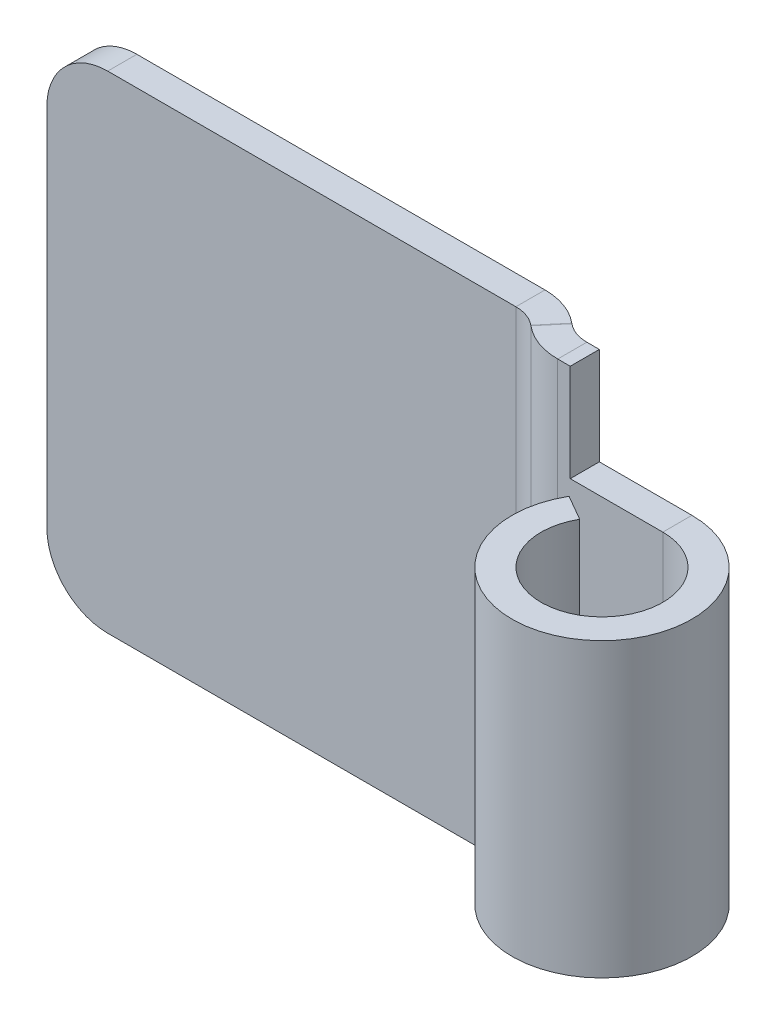
ISO-10303-21;
HEADER;
FILE_DESCRIPTION(('STEP AP214'),'2;1');
FILE_NAME('part.step','',(''),(''),'','','');
FILE_SCHEMA(('AUTOMOTIVE_DESIGN { 1 0 10303 214 1 1 1 1 }'));
ENDSEC;
DATA;
#1=APPLICATION_CONTEXT('core data for automotive mechanical design processes');
#2=APPLICATION_PROTOCOL_DEFINITION('international standard','automotive_design',2000,#1);
#3=PRODUCT_CONTEXT('',#1,'mechanical');
#4=PRODUCT('Part','Part','',(#3));
#5=PRODUCT_RELATED_PRODUCT_CATEGORY('part','',(#4));
#6=PRODUCT_DEFINITION_FORMATION('','',#4);
#7=PRODUCT_DEFINITION_CONTEXT('part definition',#1,'design');
#8=PRODUCT_DEFINITION('design','',#6,#7);
#9=PRODUCT_DEFINITION_SHAPE('','',#8);
#10=(LENGTH_UNIT() NAMED_UNIT(*) SI_UNIT(.MILLI.,.METRE.));
#11=(NAMED_UNIT(*) PLANE_ANGLE_UNIT() SI_UNIT($,.RADIAN.));
#12=(NAMED_UNIT(*) SI_UNIT($,.STERADIAN.) SOLID_ANGLE_UNIT());
#13=UNCERTAINTY_MEASURE_WITH_UNIT(LENGTH_MEASURE(1.E-05),#10,'distance_accuracy_value','');
#14=(GEOMETRIC_REPRESENTATION_CONTEXT(3) GLOBAL_UNCERTAINTY_ASSIGNED_CONTEXT((#13)) GLOBAL_UNIT_ASSIGNED_CONTEXT((#10,
#11,#12)) REPRESENTATION_CONTEXT('',''));
#15=CARTESIAN_POINT('',(0.,0.,0.));
#16=DIRECTION('',(0.,0.,1.));
#17=DIRECTION('',(1.,0.,0.));
#18=AXIS2_PLACEMENT_3D('',#15,#16,#17);
#19=CARTESIAN_POINT('',(-11.0933758316679,-9.525,-14.438108044412));
#20=DIRECTION('',(-0.642787609686541,0.,0.766044443118977));
#21=DIRECTION('',(0.766044443118977,0.,0.642787609686541));
#22=AXIS2_PLACEMENT_3D('',#19,#20,#21);
#23=PLANE('',#22);
#24=DIRECTION('',(0.766044443118977,0.,0.642787609686541));
#25=VECTOR('',#24,1.);
#26=CARTESIAN_POINT('',(-11.0933758316679,-12.7,-14.438108044412));
#27=LINE('',#26,#25);
#28=CARTESIAN_POINT('',(6.64443840069909,-12.7,0.445685335858348));
#29=VERTEX_POINT('',#28);
#30=CARTESIAN_POINT('',(6.6721699750688,-12.7,0.468954889683938));
#31=VERTEX_POINT('',#30);
#32=EDGE_CURVE('E317',#29,#31,#27,.T.);
#33=ORIENTED_EDGE('',*,*,#32,.T.);
#34=DIRECTION('',(0.,1.,0.));
#35=VECTOR('',#34,1.);
#36=CARTESIAN_POINT('',(6.6721699750688,-9.525,0.468954889683938));
#37=LINE('',#36,#35);
#38=CARTESIAN_POINT('',(6.67216997506881,12.7,0.468954889683939));
#39=VERTEX_POINT('',#38);
#40=EDGE_CURVE('E56',#31,#39,#37,.T.);
#41=ORIENTED_EDGE('',*,*,#40,.T.);
#42=DIRECTION('',(-0.766044443118977,0.,-0.642787609686541));
#43=VECTOR('',#42,1.);
#44=CARTESIAN_POINT('',(-11.0933758316679,12.7,-14.438108044412));
#45=LINE('',#44,#43);
#46=CARTESIAN_POINT('',(6.64443840069909,12.7,0.445685335858348));
#47=VERTEX_POINT('',#46);
#48=EDGE_CURVE('E78',#39,#47,#45,.T.);
#49=ORIENTED_EDGE('',*,*,#48,.T.);
#50=DIRECTION('',(0.,1.,0.));
#51=VECTOR('',#50,1.);
#52=CARTESIAN_POINT('',(6.64443840069909,-9.525,0.445685335858348));
#53=LINE('',#52,#51);
#54=EDGE_CURVE('E367',#29,#47,#53,.T.);
#55=ORIENTED_EDGE('',*,*,#54,.F.);
#56=EDGE_LOOP('',(#33,#41,#49,#55));
#57=FACE_BOUND('',#56,.T.);
#58=ADVANCED_FACE('F47',(#57),#23,.T.);
#59=CARTESIAN_POINT('',(-10.1170328755628,-12.7,-15.6016682699542));
#60=DIRECTION('',(0.,-1.,0.));
#61=DIRECTION('',(0.642787609686541,0.,-0.766044443118977));
#62=AXIS2_PLACEMENT_3D('',#59,#60,#61);
#63=PLANE('',#62);
#64=DIRECTION('',(0.766044443118977,0.,0.642787609686541));
#65=VECTOR('',#64,1.);
#66=CARTESIAN_POINT('',(-10.1170328755628,-12.7,-15.6016682699542));
#67=LINE('',#66,#65);
#68=CARTESIAN_POINT('',(7.62078135680417,-12.7,-0.717874889683928));
#69=VERTEX_POINT('',#68);
#70=CARTESIAN_POINT('',(7.64851293117388,-12.7,-0.694605335858339));
#71=VERTEX_POINT('',#70);
#72=EDGE_CURVE('E379',#69,#71,#67,.T.);
#73=ORIENTED_EDGE('',*,*,#72,.T.);
#74=DIRECTION('',(-0.642787609686541,0.,0.766044443118977));
#75=VECTOR('',#74,1.);
#76=CARTESIAN_POINT('',(7.64851293117388,-12.7,-0.694605335858339));
#77=LINE('',#76,#75);
#78=EDGE_CURVE('E12',#71,#31,#77,.T.);
#79=ORIENTED_EDGE('',*,*,#78,.T.);
#80=ORIENTED_EDGE('',*,*,#32,.F.);
#81=DIRECTION('',(-0.642787609686541,0.,0.766044443118977));
#82=VECTOR('',#81,1.);
#83=CARTESIAN_POINT('',(7.62078135680417,-12.7,-0.717874889683928));
#84=LINE('',#83,#82);
#85=EDGE_CURVE('E364',#69,#29,#84,.T.);
#86=ORIENTED_EDGE('',*,*,#85,.F.);
#87=EDGE_LOOP('',(#73,#79,#80,#86));
#88=FACE_BOUND('',#87,.T.);
#89=ADVANCED_FACE('F49',(#88),#63,.T.);
#90=CARTESIAN_POINT('',(-10.1170328755628,12.7,-15.6016682699542));
#91=DIRECTION('',(0.,1.,0.));
#92=DIRECTION('',(-0.642787609686541,0.,0.766044443118977));
#93=AXIS2_PLACEMENT_3D('',#90,#91,#92);
#94=PLANE('',#93);
#95=ORIENTED_EDGE('',*,*,#48,.F.);
#96=DIRECTION('',(0.642787609686541,0.,-0.766044443118977));
#97=VECTOR('',#96,1.);
#98=CARTESIAN_POINT('',(7.64851293117388,12.7,-0.694605335858339));
#99=LINE('',#98,#97);
#100=CARTESIAN_POINT('',(7.64851293117388,12.7,-0.694605335858339));
#101=VERTEX_POINT('',#100);
#102=EDGE_CURVE('E375',#39,#101,#99,.T.);
#103=ORIENTED_EDGE('',*,*,#102,.T.);
#104=DIRECTION('',(-0.766044443118977,0.,-0.642787609686541));
#105=VECTOR('',#104,1.);
#106=CARTESIAN_POINT('',(-10.1170328755628,12.7,-15.6016682699542));
#107=LINE('',#106,#105);
#108=CARTESIAN_POINT('',(7.62078135680417,12.7,-0.717874889683927));
#109=VERTEX_POINT('',#108);
#110=EDGE_CURVE('E51',#101,#109,#107,.T.);
#111=ORIENTED_EDGE('',*,*,#110,.T.);
#112=DIRECTION('',(0.642787609686541,0.,-0.766044443118977));
#113=VECTOR('',#112,1.);
#114=CARTESIAN_POINT('',(7.62078135680417,12.7,-0.717874889683928));
#115=LINE('',#114,#113);
#116=EDGE_CURVE('E370',#47,#109,#115,.T.);
#117=ORIENTED_EDGE('',*,*,#116,.F.);
#118=EDGE_LOOP('',(#95,#103,#111,#117));
#119=FACE_BOUND('',#118,.T.);
#120=ADVANCED_FACE('F398',(#119),#94,.T.);
#121=CARTESIAN_POINT('',(-10.1170328755628,-9.525,-15.6016682699542));
#122=DIRECTION('',(-0.642787609686541,0.,0.766044443118977));
#123=DIRECTION('',(0.766044443118977,0.,0.642787609686541));
#124=AXIS2_PLACEMENT_3D('',#121,#122,#123);
#125=PLANE('',#124);
#126=DIRECTION('',(0.,1.,0.));
#127=VECTOR('',#126,1.);
#128=CARTESIAN_POINT('',(7.64851293117388,-9.525,-0.694605335858339));
#129=LINE('',#128,#127);
#130=EDGE_CURVE('E373',#71,#101,#129,.T.);
#131=ORIENTED_EDGE('',*,*,#130,.F.);
#132=ORIENTED_EDGE('',*,*,#72,.F.);
#133=DIRECTION('',(0.,1.,0.));
#134=VECTOR('',#133,1.);
#135=CARTESIAN_POINT('',(7.62078135680417,-9.525,-0.717874889683928));
#136=LINE('',#135,#134);
#137=EDGE_CURVE('E362',#69,#109,#136,.T.);
#138=ORIENTED_EDGE('',*,*,#137,.T.);
#139=ORIENTED_EDGE('',*,*,#110,.F.);
#140=EDGE_LOOP('',(#131,#132,#138,#139));
#141=FACE_BOUND('',#140,.T.);
#142=ADVANCED_FACE('F394',(#141),#125,.F.);
#143=CARTESIAN_POINT('',(-15.875,9.525,-1.51892));
#144=DIRECTION('',(0.,0.,1.));
#145=DIRECTION('',(1.,0.,0.));
#146=AXIS2_PLACEMENT_3D('',#143,#144,#145);
#147=CYLINDRICAL_SURFACE('',#146,3.175);
#148=CARTESIAN_POINT('',(-15.875,9.525,0.));
#149=DIRECTION('',(0.,0.,1.));
#150=DIRECTION('',(1.,0.,0.));
#151=AXIS2_PLACEMENT_3D('',#148,#149,#150);
#152=CIRCLE('',#151,3.175);
#153=CARTESIAN_POINT('',(-15.875,12.7,0.));
#154=VERTEX_POINT('',#153);
#155=CARTESIAN_POINT('',(-19.05,9.52499999999998,0.));
#156=VERTEX_POINT('',#155);
#157=EDGE_CURVE('E329',#154,#156,#152,.T.);
#158=ORIENTED_EDGE('',*,*,#157,.F.);
#159=DIRECTION('',(0.,0.,1.));
#160=VECTOR('',#159,1.);
#161=CARTESIAN_POINT('',(-15.875,12.7,-1.51892));
#162=LINE('',#161,#160);
#163=CARTESIAN_POINT('',(-15.875,12.7,-1.51892));
#164=VERTEX_POINT('',#163);
#165=EDGE_CURVE('E314',#164,#154,#162,.T.);
#166=ORIENTED_EDGE('',*,*,#165,.F.);
#167=CARTESIAN_POINT('',(-15.875,9.525,-1.51892));
#168=DIRECTION('',(0.,0.,1.));
#169=DIRECTION('',(1.,0.,0.));
#170=AXIS2_PLACEMENT_3D('',#167,#168,#169);
#171=CIRCLE('',#170,3.175);
#172=CARTESIAN_POINT('',(-19.05,9.52499999999998,-1.51892));
#173=VERTEX_POINT('',#172);
#174=EDGE_CURVE('E358',#164,#173,#171,.T.);
#175=ORIENTED_EDGE('',*,*,#174,.T.);
#176=DIRECTION('',(0.,0.,1.));
#177=VECTOR('',#176,1.);
#178=CARTESIAN_POINT('',(-19.05,9.52499999999998,-1.51892));
#179=LINE('',#178,#177);
#180=EDGE_CURVE('E356',#173,#156,#179,.T.);
#181=ORIENTED_EDGE('',*,*,#180,.T.);
#182=EDGE_LOOP('',(#158,#166,#175,#181));
#183=FACE_BOUND('',#182,.T.);
#184=ADVANCED_FACE('F482',(#183),#147,.T.);
#185=CARTESIAN_POINT('',(-19.05,9.52499999999998,-1.51892));
#186=DIRECTION('',(-1.,0.,0.));
#187=DIRECTION('',(0.,-1.,0.));
#188=AXIS2_PLACEMENT_3D('',#185,#186,#187);
#189=PLANE('',#188);
#190=DIRECTION('',(0.,-1.,0.));
#191=VECTOR('',#190,1.);
#192=CARTESIAN_POINT('',(-19.05,9.52499999999998,0.));
#193=LINE('',#192,#191);
#194=CARTESIAN_POINT('',(-19.05,-9.52499999999997,0.));
#195=VERTEX_POINT('',#194);
#196=EDGE_CURVE('E326',#156,#195,#193,.T.);
#197=ORIENTED_EDGE('',*,*,#196,.F.);
#198=ORIENTED_EDGE('',*,*,#180,.F.);
#199=DIRECTION('',(0.,-1.,0.));
#200=VECTOR('',#199,1.);
#201=CARTESIAN_POINT('',(-19.05,9.52499999999998,-1.51892));
#202=LINE('',#201,#200);
#203=CARTESIAN_POINT('',(-19.05,-9.52499999999997,-1.51892));
#204=VERTEX_POINT('',#203);
#205=EDGE_CURVE('E353',#173,#204,#202,.T.);
#206=ORIENTED_EDGE('',*,*,#205,.T.);
#207=DIRECTION('',(0.,0.,1.));
#208=VECTOR('',#207,1.);
#209=CARTESIAN_POINT('',(-19.05,-9.52499999999997,-1.51892));
#210=LINE('',#209,#208);
#211=EDGE_CURVE('E351',#204,#195,#210,.T.);
#212=ORIENTED_EDGE('',*,*,#211,.T.);
#213=EDGE_LOOP('',(#197,#198,#206,#212));
#214=FACE_BOUND('',#213,.T.);
#215=ADVANCED_FACE('F503',(#214),#189,.T.);
#216=CARTESIAN_POINT('',(-15.875,-9.525,-1.51892));
#217=DIRECTION('',(0.,0.,1.));
#218=DIRECTION('',(1.,0.,0.));
#219=AXIS2_PLACEMENT_3D('',#216,#217,#218);
#220=CYLINDRICAL_SURFACE('',#219,3.175);
#221=CARTESIAN_POINT('',(-15.875,-9.525,0.));
#222=DIRECTION('',(0.,0.,1.));
#223=DIRECTION('',(1.,0.,0.));
#224=AXIS2_PLACEMENT_3D('',#221,#222,#223);
#225=CIRCLE('',#224,3.175);
#226=CARTESIAN_POINT('',(-15.875,-12.7,0.));
#227=VERTEX_POINT('',#226);
#228=EDGE_CURVE('E323',#195,#227,#225,.T.);
#229=ORIENTED_EDGE('',*,*,#228,.F.);
#230=ORIENTED_EDGE('',*,*,#211,.F.);
#231=CARTESIAN_POINT('',(-15.875,-9.525,-1.51892));
#232=DIRECTION('',(0.,0.,1.));
#233=DIRECTION('',(1.,0.,0.));
#234=AXIS2_PLACEMENT_3D('',#231,#232,#233);
#235=CIRCLE('',#234,3.175);
#236=CARTESIAN_POINT('',(-15.875,-12.7,-1.51892));
#237=VERTEX_POINT('',#236);
#238=EDGE_CURVE('E348',#204,#237,#235,.T.);
#239=ORIENTED_EDGE('',*,*,#238,.T.);
#240=DIRECTION('',(0.,0.,1.));
#241=VECTOR('',#240,1.);
#242=CARTESIAN_POINT('',(-15.875,-12.7,-1.51892));
#243=LINE('',#242,#241);
#244=EDGE_CURVE('E346',#237,#227,#243,.T.);
#245=ORIENTED_EDGE('',*,*,#244,.T.);
#246=EDGE_LOOP('',(#229,#230,#239,#245));
#247=FACE_BOUND('',#246,.T.);
#248=ADVANCED_FACE('F499',(#247),#220,.T.);
#249=CARTESIAN_POINT('',(-15.875,-9.525,-1.51892));
#250=DIRECTION('',(0.,0.,1.));
#251=DIRECTION('',(1.,0.,0.));
#252=AXIS2_PLACEMENT_3D('',#249,#250,#251);
#253=PLANE('',#252);
#254=DIRECTION('',(0.,1.,0.));
#255=VECTOR('',#254,1.);
#256=CARTESIAN_POINT('',(5.41992800424623,-9.525,-1.51892));
#257=LINE('',#256,#255);
#258=CARTESIAN_POINT('',(5.41992800424623,-12.7,-1.51892));
#259=VERTEX_POINT('',#258);
#260=CARTESIAN_POINT('',(5.41992800424623,12.7,-1.51892));
#261=VERTEX_POINT('',#260);
#262=EDGE_CURVE('E310',#259,#261,#257,.T.);
#263=ORIENTED_EDGE('',*,*,#262,.F.);
#264=DIRECTION('',(1.,0.,0.));
#265=VECTOR('',#264,1.);
#266=CARTESIAN_POINT('',(-15.875,-12.7,-1.51892));
#267=LINE('',#266,#265);
#268=EDGE_CURVE('E343',#237,#259,#267,.T.);
#269=ORIENTED_EDGE('',*,*,#268,.F.);
#270=ORIENTED_EDGE('',*,*,#238,.F.);
#271=ORIENTED_EDGE('',*,*,#205,.F.);
#272=ORIENTED_EDGE('',*,*,#174,.F.);
#273=DIRECTION('',(-1.,0.,0.));
#274=VECTOR('',#273,1.);
#275=CARTESIAN_POINT('',(-15.875,12.7,-1.51892));
#276=LINE('',#275,#274);
#277=EDGE_CURVE('E318',#261,#164,#276,.T.);
#278=ORIENTED_EDGE('',*,*,#277,.F.);
#279=EDGE_LOOP('',(#263,#269,#270,#271,#272,#278));
#280=FACE_BOUND('',#279,.T.);
#281=ADVANCED_FACE('F495',(#280),#253,.F.);
#282=CARTESIAN_POINT('',(-15.875,-12.7,-1.51892));
#283=DIRECTION('',(0.,-1.,0.));
#284=DIRECTION('',(0.,0.,-1.));
#285=AXIS2_PLACEMENT_3D('',#282,#283,#284);
#286=PLANE('',#285);
#287=ORIENTED_EDGE('',*,*,#268,.T.);
#288=DIRECTION('',(0.,0.,1.));
#289=VECTOR('',#288,1.);
#290=CARTESIAN_POINT('',(5.41992800424623,-12.7,-1.51892));
#291=LINE('',#290,#289);
#292=CARTESIAN_POINT('',(5.41992800424623,-12.7,0.));
#293=VERTEX_POINT('',#292);
#294=EDGE_CURVE('E340',#259,#293,#291,.T.);
#295=ORIENTED_EDGE('',*,*,#294,.T.);
#296=DIRECTION('',(1.,0.,0.));
#297=VECTOR('',#296,1.);
#298=CARTESIAN_POINT('',(-15.875,-12.7,0.));
#299=LINE('',#298,#297);
#300=EDGE_CURVE('E337',#227,#293,#299,.T.);
#301=ORIENTED_EDGE('',*,*,#300,.F.);
#302=ORIENTED_EDGE('',*,*,#244,.F.);
#303=EDGE_LOOP('',(#287,#295,#301,#302));
#304=FACE_BOUND('',#303,.T.);
#305=ADVANCED_FACE('F491',(#304),#286,.T.);
#306=CARTESIAN_POINT('',(-15.875,-9.525,0.));
#307=DIRECTION('',(0.,0.,1.));
#308=DIRECTION('',(1.,0.,0.));
#309=AXIS2_PLACEMENT_3D('',#306,#307,#308);
#310=PLANE('',#309);
#311=ORIENTED_EDGE('',*,*,#300,.T.);
#312=DIRECTION('',(0.,1.,0.));
#313=VECTOR('',#312,1.);
#314=CARTESIAN_POINT('',(5.41992800424623,-9.525,0.));
#315=LINE('',#314,#313);
#316=CARTESIAN_POINT('',(5.41992800424623,12.7,0.));
#317=VERTEX_POINT('',#316);
#318=EDGE_CURVE('E334',#293,#317,#315,.T.);
#319=ORIENTED_EDGE('',*,*,#318,.T.);
#320=DIRECTION('',(-1.,0.,0.));
#321=VECTOR('',#320,1.);
#322=CARTESIAN_POINT('',(-15.875,12.7,0.));
#323=LINE('',#322,#321);
#324=EDGE_CURVE('E332',#317,#154,#323,.T.);
#325=ORIENTED_EDGE('',*,*,#324,.T.);
#326=ORIENTED_EDGE('',*,*,#157,.T.);
#327=ORIENTED_EDGE('',*,*,#196,.T.);
#328=ORIENTED_EDGE('',*,*,#228,.T.);
#329=EDGE_LOOP('',(#311,#319,#325,#326,#327,#328));
#330=FACE_BOUND('',#329,.T.);
#331=ADVANCED_FACE('F487',(#330),#310,.T.);
#332=CARTESIAN_POINT('',(-15.875,12.7,-1.51892));
#333=DIRECTION('',(0.,1.,0.));
#334=DIRECTION('',(0.,0.,1.));
#335=AXIS2_PLACEMENT_3D('',#332,#333,#334);
#336=PLANE('',#335);
#337=ORIENTED_EDGE('',*,*,#324,.F.);
#338=DIRECTION('',(0.,0.,-1.));
#339=VECTOR('',#338,1.);
#340=CARTESIAN_POINT('',(5.41992800424623,12.7,-1.51892));
#341=LINE('',#340,#339);
#342=EDGE_CURVE('E320',#317,#261,#341,.T.);
#343=ORIENTED_EDGE('',*,*,#342,.T.);
#344=ORIENTED_EDGE('',*,*,#277,.T.);
#345=ORIENTED_EDGE('',*,*,#165,.T.);
#346=EDGE_LOOP('',(#337,#343,#344,#345));
#347=FACE_BOUND('',#346,.T.);
#348=ADVANCED_FACE('F483',(#347),#336,.T.);
#349=CARTESIAN_POINT('',(5.41992800424623,-12.7,1.905));
#350=DIRECTION('',(0.,-1.,0.));
#351=DIRECTION('',(0.,0.,-1.));
#352=AXIS2_PLACEMENT_3D('',#349,#350,#351);
#353=PLANE('',#352);
#354=ORIENTED_EDGE('',*,*,#85,.T.);
#355=CARTESIAN_POINT('',(5.41992800424623,-12.7,1.905));
#356=DIRECTION('',(0.,-1.,0.));
#357=DIRECTION('',(0.,0.,-1.));
#358=AXIS2_PLACEMENT_3D('',#355,#356,#357);
#359=CIRCLE('',#358,1.905);
#360=EDGE_CURVE('E299',#29,#293,#359,.F.);
#361=ORIENTED_EDGE('',*,*,#360,.T.);
#362=ORIENTED_EDGE('',*,*,#294,.F.);
#363=CARTESIAN_POINT('',(5.41992800424623,-12.7,1.905));
#364=DIRECTION('',(0.,1.,0.));
#365=DIRECTION('',(0.,0.,-1.));
#366=AXIS2_PLACEMENT_3D('',#363,#364,#365);
#367=CIRCLE('',#366,3.42392);
#368=EDGE_CURVE('E303',#69,#259,#367,.T.);
#369=ORIENTED_EDGE('',*,*,#368,.F.);
#370=EDGE_LOOP('',(#354,#361,#362,#369));
#371=FACE_BOUND('',#370,.T.);
#372=ADVANCED_FACE('F486',(#371),#353,.T.);
#373=CARTESIAN_POINT('',(5.41992800424623,12.7,1.905));
#374=DIRECTION('',(0.,1.,0.));
#375=DIRECTION('',(0.,0.,1.));
#376=AXIS2_PLACEMENT_3D('',#373,#374,#375);
#377=PLANE('',#376);
#378=ORIENTED_EDGE('',*,*,#342,.F.);
#379=CARTESIAN_POINT('',(5.41992800424623,12.7,1.905));
#380=DIRECTION('',(0.,-1.,0.));
#381=DIRECTION('',(0.,0.,-1.));
#382=AXIS2_PLACEMENT_3D('',#379,#380,#381);
#383=CIRCLE('',#382,1.905);
#384=EDGE_CURVE('E307',#317,#47,#383,.T.);
#385=ORIENTED_EDGE('',*,*,#384,.T.);
#386=ORIENTED_EDGE('',*,*,#116,.T.);
#387=CARTESIAN_POINT('',(5.41992800424623,12.7,1.905));
#388=DIRECTION('',(0.,-1.,0.));
#389=DIRECTION('',(0.,0.,1.));
#390=AXIS2_PLACEMENT_3D('',#387,#388,#389);
#391=CIRCLE('',#390,3.42392);
#392=EDGE_CURVE('E306',#261,#109,#391,.T.);
#393=ORIENTED_EDGE('',*,*,#392,.F.);
#394=EDGE_LOOP('',(#378,#385,#386,#393));
#395=FACE_BOUND('',#394,.T.);
#396=ADVANCED_FACE('F513',(#395),#377,.T.);
#397=CARTESIAN_POINT('',(5.41992800424623,25.5132760271107,1.905));
#398=DIRECTION('',(0.,-1.,0.));
#399=DIRECTION('',(0.,0.,-1.));
#400=AXIS2_PLACEMENT_3D('',#397,#398,#399);
#401=CYLINDRICAL_SURFACE('',#400,3.42392);
#402=ORIENTED_EDGE('',*,*,#392,.T.);
#403=ORIENTED_EDGE('',*,*,#137,.F.);
#404=ORIENTED_EDGE('',*,*,#368,.T.);
#405=ORIENTED_EDGE('',*,*,#262,.T.);
#406=EDGE_LOOP('',(#402,#403,#404,#405));
#407=FACE_BOUND('',#406,.T.);
#408=ADVANCED_FACE('F517',(#407),#401,.T.);
#409=CARTESIAN_POINT('',(5.41992800424623,25.5132760271107,1.905));
#410=DIRECTION('',(0.,-1.,0.));
#411=DIRECTION('',(0.,0.,-1.));
#412=AXIS2_PLACEMENT_3D('',#409,#410,#411);
#413=CYLINDRICAL_SURFACE('',#412,1.905);
#414=ORIENTED_EDGE('',*,*,#384,.F.);
#415=ORIENTED_EDGE('',*,*,#318,.F.);
#416=ORIENTED_EDGE('',*,*,#360,.F.);
#417=ORIENTED_EDGE('',*,*,#54,.T.);
#418=EDGE_LOOP('',(#414,#415,#416,#417));
#419=FACE_BOUND('',#418,.T.);
#420=ADVANCED_FACE('F519',(#419),#413,.F.);
#421=CARTESIAN_POINT('',(8.87302332762674,-12.7,-2.15391999999999));
#422=DIRECTION('',(0.,1.,0.));
#423=DIRECTION('',(0.,0.,1.));
#424=AXIS2_PLACEMENT_3D('',#421,#422,#423);
#425=PLANE('',#424);
#426=DIRECTION('',(0.,0.,1.));
#427=VECTOR('',#426,1.);
#428=CARTESIAN_POINT('',(8.87302332762675,-12.7,-0.248919999999988));
#429=LINE('',#428,#427);
#430=CARTESIAN_POINT('',(8.87302332762675,-12.7,-0.248919999999988));
#431=VERTEX_POINT('',#430);
#432=CARTESIAN_POINT('',(8.87302332762675,-12.7,1.27000000000001));
#433=VERTEX_POINT('',#432);
#434=EDGE_CURVE('E234',#431,#433,#429,.T.);
#435=ORIENTED_EDGE('',*,*,#434,.T.);
#436=CARTESIAN_POINT('',(8.87302332762674,-12.7,-2.15391999999999));
#437=DIRECTION('',(0.,-1.,0.));
#438=DIRECTION('',(0.,0.,-1.));
#439=AXIS2_PLACEMENT_3D('',#436,#437,#438);
#440=CIRCLE('',#439,3.42392);
#441=EDGE_CURVE('E67',#433,#31,#440,.T.);
#442=ORIENTED_EDGE('',*,*,#441,.T.);
#443=ORIENTED_EDGE('',*,*,#78,.F.);
#444=CARTESIAN_POINT('',(8.87302332762674,-12.7,-2.15391999999999));
#445=DIRECTION('',(0.,-1.,0.));
#446=DIRECTION('',(0.,0.,1.));
#447=AXIS2_PLACEMENT_3D('',#444,#445,#446);
#448=CIRCLE('',#447,1.905);
#449=EDGE_CURVE('E292',#431,#71,#448,.T.);
#450=ORIENTED_EDGE('',*,*,#449,.F.);
#451=EDGE_LOOP('',(#435,#442,#443,#450));
#452=FACE_BOUND('',#451,.T.);
#453=ADVANCED_FACE('F385',(#452),#425,.F.);
#454=CARTESIAN_POINT('',(8.87302332762674,12.7,-2.15391999999999));
#455=DIRECTION('',(0.,-1.,0.));
#456=DIRECTION('',(0.,0.,-1.));
#457=AXIS2_PLACEMENT_3D('',#454,#455,#456);
#458=PLANE('',#457);
#459=ORIENTED_EDGE('',*,*,#102,.F.);
#460=CARTESIAN_POINT('',(8.87302332762674,12.7,-2.15391999999999));
#461=DIRECTION('',(0.,-1.,0.));
#462=DIRECTION('',(0.,0.,-1.));
#463=AXIS2_PLACEMENT_3D('',#460,#461,#462);
#464=CIRCLE('',#463,3.42392);
#465=CARTESIAN_POINT('',(8.87302332762674,12.7,1.27000000000001));
#466=VERTEX_POINT('',#465);
#467=EDGE_CURVE('E296',#39,#466,#464,.F.);
#468=ORIENTED_EDGE('',*,*,#467,.T.);
#469=DIRECTION('',(0.,0.,-1.));
#470=VECTOR('',#469,1.);
#471=CARTESIAN_POINT('',(8.87302332762674,12.7,-0.248919999999988));
#472=LINE('',#471,#470);
#473=CARTESIAN_POINT('',(8.87302332762674,12.7,-0.24891999999999));
#474=VERTEX_POINT('',#473);
#475=EDGE_CURVE('E285',#466,#474,#472,.T.);
#476=ORIENTED_EDGE('',*,*,#475,.T.);
#477=CARTESIAN_POINT('',(8.87302332762674,12.7,-2.15391999999999));
#478=DIRECTION('',(0.,1.,0.));
#479=DIRECTION('',(0.,0.,-1.));
#480=AXIS2_PLACEMENT_3D('',#477,#478,#479);
#481=CIRCLE('',#480,1.905);
#482=EDGE_CURVE('E295',#101,#474,#481,.T.);
#483=ORIENTED_EDGE('',*,*,#482,.F.);
#484=EDGE_LOOP('',(#459,#468,#476,#483));
#485=FACE_BOUND('',#484,.T.);
#486=ADVANCED_FACE('F401',(#485),#458,.F.);
#487=CARTESIAN_POINT('',(8.87302332762674,25.6221042228828,-2.15391999999999));
#488=DIRECTION('',(0.,-1.,0.));
#489=DIRECTION('',(0.,0.,-1.));
#490=AXIS2_PLACEMENT_3D('',#487,#488,#489);
#491=CYLINDRICAL_SURFACE('',#490,1.905);
#492=ORIENTED_EDGE('',*,*,#482,.T.);
#493=DIRECTION('',(0.,1.,0.));
#494=VECTOR('',#493,1.);
#495=CARTESIAN_POINT('',(8.87302332762674,-9.525,-0.248919999999988));
#496=LINE('',#495,#494);
#497=EDGE_CURVE('E391',#431,#474,#496,.T.);
#498=ORIENTED_EDGE('',*,*,#497,.F.);
#499=ORIENTED_EDGE('',*,*,#449,.T.);
#500=ORIENTED_EDGE('',*,*,#130,.T.);
#501=EDGE_LOOP('',(#492,#498,#499,#500));
#502=FACE_BOUND('',#501,.T.);
#503=ADVANCED_FACE('F389',(#502),#491,.F.);
#504=CARTESIAN_POINT('',(8.87302332762674,25.6221042228828,-2.15391999999999));
#505=DIRECTION('',(0.,-1.,0.));
#506=DIRECTION('',(0.,0.,-1.));
#507=AXIS2_PLACEMENT_3D('',#504,#505,#506);
#508=CYLINDRICAL_SURFACE('',#507,3.42392);
#509=ORIENTED_EDGE('',*,*,#467,.F.);
#510=ORIENTED_EDGE('',*,*,#40,.F.);
#511=ORIENTED_EDGE('',*,*,#441,.F.);
#512=DIRECTION('',(0.,1.,0.));
#513=VECTOR('',#512,1.);
#514=CARTESIAN_POINT('',(8.87302332762674,-9.525,1.27000000000001));
#515=LINE('',#514,#513);
#516=EDGE_CURVE('E288',#433,#466,#515,.T.);
#517=ORIENTED_EDGE('',*,*,#516,.T.);
#518=EDGE_LOOP('',(#509,#510,#511,#517));
#519=FACE_BOUND('',#518,.T.);
#520=ADVANCED_FACE('F403',(#519),#508,.T.);
#521=CARTESIAN_POINT('',(14.35608,-7.62,4.44500000000001));
#522=DIRECTION('',(0.,-1.,0.));
#523=DIRECTION('',(0.,0.,-1.));
#524=AXIS2_PLACEMENT_3D('',#521,#522,#523);
#525=PLANE('',#524);
#526=DIRECTION('',(-0.866025403784433,0.,-0.50000000000001));
#527=VECTOR('',#526,1.);
#528=CARTESIAN_POINT('',(11.6064493429844,-7.62,2.85749999999998));
#529=LINE('',#528,#527);
#530=CARTESIAN_POINT('',(11.6064493429844,-7.62,2.85749999999998));
#531=VERTEX_POINT('',#530);
#532=CARTESIAN_POINT('',(10.2910260366682,-7.62,2.09803999999997));
#533=VERTEX_POINT('',#532);
#534=EDGE_CURVE('E277',#531,#533,#529,.T.);
#535=ORIENTED_EDGE('',*,*,#534,.F.);
#536=CARTESIAN_POINT('',(14.35608,-7.62,4.44500000000001));
#537=DIRECTION('',(0.,1.,0.));
#538=DIRECTION('',(0.,0.,1.));
#539=AXIS2_PLACEMENT_3D('',#536,#537,#538);
#540=CIRCLE('',#539,3.175);
#541=CARTESIAN_POINT('',(14.35608,-7.62,1.27000000000001));
#542=VERTEX_POINT('',#541);
#543=EDGE_CURVE('E263',#542,#531,#540,.F.);
#544=ORIENTED_EDGE('',*,*,#543,.F.);
#545=DIRECTION('',(0.,0.,-1.));
#546=VECTOR('',#545,1.);
#547=CARTESIAN_POINT('',(14.35608,-7.62,1.27000000000001));
#548=LINE('',#547,#546);
#549=CARTESIAN_POINT('',(14.35608,-7.62,-0.24891999999999));
#550=VERTEX_POINT('',#549);
#551=EDGE_CURVE('E282',#542,#550,#548,.T.);
#552=ORIENTED_EDGE('',*,*,#551,.T.);
#553=CARTESIAN_POINT('',(14.35608,-7.62,4.44500000000001));
#554=DIRECTION('',(0.,1.,0.));
#555=DIRECTION('',(0.,0.,1.));
#556=AXIS2_PLACEMENT_3D('',#553,#554,#555);
#557=CIRCLE('',#556,4.69392);
#558=EDGE_CURVE('E279',#550,#533,#557,.F.);
#559=ORIENTED_EDGE('',*,*,#558,.T.);
#560=EDGE_LOOP('',(#535,#544,#552,#559));
#561=FACE_BOUND('',#560,.T.);
#562=ADVANCED_FACE('F446',(#561),#525,.T.);
#563=CARTESIAN_POINT('',(11.6064493429844,0.,2.85749999999998));
#564=DIRECTION('',(-0.50000000000001,0.,0.866025403784433));
#565=DIRECTION('',(0.,1.,0.));
#566=AXIS2_PLACEMENT_3D('',#563,#564,#565);
#567=PLANE('',#566);
#568=DIRECTION('',(-0.866025403784433,0.,-0.50000000000001));
#569=VECTOR('',#568,1.);
#570=CARTESIAN_POINT('',(11.6064493429844,7.62,2.85749999999998));
#571=LINE('',#570,#569);
#572=CARTESIAN_POINT('',(11.6064493429844,7.62,2.85749999999998));
#573=VERTEX_POINT('',#572);
#574=CARTESIAN_POINT('',(10.2910260366682,7.62,2.09803999999997));
#575=VERTEX_POINT('',#574);
#576=EDGE_CURVE('E272',#573,#575,#571,.T.);
#577=ORIENTED_EDGE('',*,*,#576,.F.);
#578=DIRECTION('',(0.,1.,0.));
#579=VECTOR('',#578,1.);
#580=CARTESIAN_POINT('',(11.6064493429844,7.62,2.85749999999998));
#581=LINE('',#580,#579);
#582=EDGE_CURVE('E257',#531,#573,#581,.T.);
#583=ORIENTED_EDGE('',*,*,#582,.F.);
#584=ORIENTED_EDGE('',*,*,#534,.T.);
#585=DIRECTION('',(0.,1.,0.));
#586=VECTOR('',#585,1.);
#587=CARTESIAN_POINT('',(10.2910260366682,7.62,2.09803999999997));
#588=LINE('',#587,#586);
#589=EDGE_CURVE('E274',#533,#575,#588,.T.);
#590=ORIENTED_EDGE('',*,*,#589,.T.);
#591=EDGE_LOOP('',(#577,#583,#584,#590));
#592=FACE_BOUND('',#591,.T.);
#593=ADVANCED_FACE('F450',(#592),#567,.F.);
#594=CARTESIAN_POINT('',(14.35608,7.62,4.44500000000001));
#595=DIRECTION('',(0.,-1.,0.));
#596=DIRECTION('',(0.,0.,-1.));
#597=AXIS2_PLACEMENT_3D('',#594,#595,#596);
#598=PLANE('',#597);
#599=CARTESIAN_POINT('',(14.35608,7.62,4.44500000000001));
#600=DIRECTION('',(0.,1.,0.));
#601=DIRECTION('',(0.,0.,1.));
#602=AXIS2_PLACEMENT_3D('',#599,#600,#601);
#603=CIRCLE('',#602,3.175);
#604=CARTESIAN_POINT('',(14.35608,7.62,1.27000000000001));
#605=VERTEX_POINT('',#604);
#606=EDGE_CURVE('E253',#573,#605,#603,.T.);
#607=ORIENTED_EDGE('',*,*,#606,.F.);
#608=ORIENTED_EDGE('',*,*,#576,.T.);
#609=CARTESIAN_POINT('',(14.35608,7.62,4.44500000000001));
#610=DIRECTION('',(0.,1.,0.));
#611=DIRECTION('',(0.,0.,1.));
#612=AXIS2_PLACEMENT_3D('',#609,#610,#611);
#613=CIRCLE('',#612,4.69392);
#614=CARTESIAN_POINT('',(14.35608,7.62,-0.248919999999986));
#615=VERTEX_POINT('',#614);
#616=EDGE_CURVE('E269',#575,#615,#613,.T.);
#617=ORIENTED_EDGE('',*,*,#616,.T.);
#618=DIRECTION('',(0.,0.,-1.));
#619=VECTOR('',#618,1.);
#620=CARTESIAN_POINT('',(14.35608,7.62,1.27000000000001));
#621=LINE('',#620,#619);
#622=EDGE_CURVE('E434',#605,#615,#621,.T.);
#623=ORIENTED_EDGE('',*,*,#622,.F.);
#624=EDGE_LOOP('',(#607,#608,#617,#623));
#625=FACE_BOUND('',#624,.T.);
#626=ADVANCED_FACE('F464',(#625),#598,.F.);
#627=CARTESIAN_POINT('',(14.35608,7.62,4.44500000000001));
#628=DIRECTION('',(0.,1.,0.));
#629=DIRECTION('',(-0.866025403784433,0.,-0.500000000000011));
#630=AXIS2_PLACEMENT_3D('',#627,#628,#629);
#631=CYLINDRICAL_SURFACE('',#630,3.175);
#632=DIRECTION('',(0.,1.,0.));
#633=VECTOR('',#632,1.);
#634=CARTESIAN_POINT('',(14.35608,7.62,1.27000000000001));
#635=LINE('',#634,#633);
#636=EDGE_CURVE('E266',#605,#542,#635,.F.);
#637=ORIENTED_EDGE('',*,*,#636,.T.);
#638=ORIENTED_EDGE('',*,*,#543,.T.);
#639=ORIENTED_EDGE('',*,*,#582,.T.);
#640=ORIENTED_EDGE('',*,*,#606,.T.);
#641=EDGE_LOOP('',(#637,#638,#639,#640));
#642=FACE_BOUND('',#641,.T.);
#643=ADVANCED_FACE('F454',(#642),#631,.F.);
#644=CARTESIAN_POINT('',(9.52500000000002,-7.62,-0.248919999999988));
#645=DIRECTION('',(1.,0.,0.));
#646=DIRECTION('',(0.,1.,0.));
#647=AXIS2_PLACEMENT_3D('',#644,#645,#646);
#648=PLANE('',#647);
#649=DIRECTION('',(0.,1.,0.));
#650=VECTOR('',#649,1.);
#651=CARTESIAN_POINT('',(9.52500000000002,-7.62,1.27000000000001));
#652=LINE('',#651,#650);
#653=CARTESIAN_POINT('',(9.525,-12.7,1.27000000000001));
#654=VERTEX_POINT('',#653);
#655=CARTESIAN_POINT('',(9.52500000000002,-7.62,1.27000000000001));
#656=VERTEX_POINT('',#655);
#657=EDGE_CURVE('E246',#654,#656,#652,.T.);
#658=ORIENTED_EDGE('',*,*,#657,.F.);
#659=DIRECTION('',(0.,0.,1.));
#660=VECTOR('',#659,1.);
#661=CARTESIAN_POINT('',(9.525,-12.7,-0.248919999999987));
#662=LINE('',#661,#660);
#663=CARTESIAN_POINT('',(9.525,-12.7,-0.248919999999987));
#664=VERTEX_POINT('',#663);
#665=EDGE_CURVE('E232',#664,#654,#662,.T.);
#666=ORIENTED_EDGE('',*,*,#665,.F.);
#667=DIRECTION('',(0.,1.,0.));
#668=VECTOR('',#667,1.);
#669=CARTESIAN_POINT('',(9.52500000000002,-7.62,-0.248919999999988));
#670=LINE('',#669,#668);
#671=CARTESIAN_POINT('',(9.52500000000002,-7.62,-0.248919999999988));
#672=VERTEX_POINT('',#671);
#673=EDGE_CURVE('E244',#664,#672,#670,.T.);
#674=ORIENTED_EDGE('',*,*,#673,.T.);
#675=DIRECTION('',(0.,0.,1.));
#676=VECTOR('',#675,1.);
#677=CARTESIAN_POINT('',(9.52500000000002,-7.62,-0.248919999999988));
#678=LINE('',#677,#676);
#679=EDGE_CURVE('E252',#672,#656,#678,.T.);
#680=ORIENTED_EDGE('',*,*,#679,.T.);
#681=EDGE_LOOP('',(#658,#666,#674,#680));
#682=FACE_BOUND('',#681,.T.);
#683=ADVANCED_FACE('F243',(#682),#648,.T.);
#684=CARTESIAN_POINT('',(19.05,-7.62,-0.248919999999985));
#685=DIRECTION('',(0.,-1.,0.));
#686=DIRECTION('',(1.,0.,0.));
#687=AXIS2_PLACEMENT_3D('',#684,#685,#686);
#688=PLANE('',#687);
#689=ORIENTED_EDGE('',*,*,#551,.F.);
#690=DIRECTION('',(1.,0.,0.));
#691=VECTOR('',#690,1.);
#692=CARTESIAN_POINT('',(19.05,-7.62,1.27000000000001));
#693=LINE('',#692,#691);
#694=EDGE_CURVE('E457',#656,#542,#693,.T.);
#695=ORIENTED_EDGE('',*,*,#694,.F.);
#696=ORIENTED_EDGE('',*,*,#679,.F.);
#697=DIRECTION('',(1.,0.,0.));
#698=VECTOR('',#697,1.);
#699=CARTESIAN_POINT('',(19.05,-7.62,-0.248919999999985));
#700=LINE('',#699,#698);
#701=EDGE_CURVE('E251',#672,#550,#700,.T.);
#702=ORIENTED_EDGE('',*,*,#701,.T.);
#703=EDGE_LOOP('',(#689,#695,#696,#702));
#704=FACE_BOUND('',#703,.T.);
#705=ADVANCED_FACE('F437',(#704),#688,.T.);
#706=CARTESIAN_POINT('',(14.35608,7.62,4.44500000000001));
#707=DIRECTION('',(0.,1.,0.));
#708=DIRECTION('',(-0.866025403784433,0.,-0.500000000000011));
#709=AXIS2_PLACEMENT_3D('',#706,#707,#708);
#710=CYLINDRICAL_SURFACE('',#709,4.69392);
#711=DIRECTION('',(0.,1.,0.));
#712=VECTOR('',#711,1.);
#713=CARTESIAN_POINT('',(14.35608,7.62,-0.248919999999991));
#714=LINE('',#713,#712);
#715=EDGE_CURVE('E421',#615,#550,#714,.F.);
#716=ORIENTED_EDGE('',*,*,#715,.F.);
#717=ORIENTED_EDGE('',*,*,#616,.F.);
#718=ORIENTED_EDGE('',*,*,#589,.F.);
#719=ORIENTED_EDGE('',*,*,#558,.F.);
#720=EDGE_LOOP('',(#716,#717,#718,#719));
#721=FACE_BOUND('',#720,.T.);
#722=ADVANCED_FACE('F448',(#721),#710,.T.);
#723=CARTESIAN_POINT('',(19.05,7.62,-0.248919999999985));
#724=DIRECTION('',(0.,1.,0.));
#725=DIRECTION('',(-1.,0.,0.));
#726=AXIS2_PLACEMENT_3D('',#723,#724,#725);
#727=PLANE('',#726);
#728=DIRECTION('',(-1.,0.,0.));
#729=VECTOR('',#728,1.);
#730=CARTESIAN_POINT('',(19.05,7.62,1.27000000000001));
#731=LINE('',#730,#729);
#732=CARTESIAN_POINT('',(9.52500000000002,7.62,1.27000000000001));
#733=VERTEX_POINT('',#732);
#734=EDGE_CURVE('E456',#605,#733,#731,.T.);
#735=ORIENTED_EDGE('',*,*,#734,.F.);
#736=ORIENTED_EDGE('',*,*,#622,.T.);
#737=DIRECTION('',(-1.,0.,0.));
#738=VECTOR('',#737,1.);
#739=CARTESIAN_POINT('',(19.05,7.62,-0.248919999999985));
#740=LINE('',#739,#738);
#741=CARTESIAN_POINT('',(9.52500000000002,7.62,-0.248919999999988));
#742=VERTEX_POINT('',#741);
#743=EDGE_CURVE('E432',#615,#742,#740,.T.);
#744=ORIENTED_EDGE('',*,*,#743,.T.);
#745=DIRECTION('',(0.,0.,1.));
#746=VECTOR('',#745,1.);
#747=CARTESIAN_POINT('',(9.52500000000002,7.62,-0.248919999999988));
#748=LINE('',#747,#746);
#749=EDGE_CURVE('E429',#742,#733,#748,.T.);
#750=ORIENTED_EDGE('',*,*,#749,.T.);
#751=EDGE_LOOP('',(#735,#736,#744,#750));
#752=FACE_BOUND('',#751,.T.);
#753=ADVANCED_FACE('F460',(#752),#727,.T.);
#754=CARTESIAN_POINT('',(9.52500000000002,7.62,-0.248919999999988));
#755=DIRECTION('',(1.,0.,0.));
#756=DIRECTION('',(0.,1.,0.));
#757=AXIS2_PLACEMENT_3D('',#754,#755,#756);
#758=PLANE('',#757);
#759=DIRECTION('',(0.,1.,0.));
#760=VECTOR('',#759,1.);
#761=CARTESIAN_POINT('',(9.52500000000002,7.62,1.27000000000001));
#762=LINE('',#761,#760);
#763=CARTESIAN_POINT('',(9.52499999999999,12.7,1.27000000000001));
#764=VERTEX_POINT('',#763);
#765=EDGE_CURVE('E411',#733,#764,#762,.T.);
#766=ORIENTED_EDGE('',*,*,#765,.F.);
#767=ORIENTED_EDGE('',*,*,#749,.F.);
#768=DIRECTION('',(0.,1.,0.));
#769=VECTOR('',#768,1.);
#770=CARTESIAN_POINT('',(9.52500000000002,7.62,-0.248919999999988));
#771=LINE('',#770,#769);
#772=CARTESIAN_POINT('',(9.52499999999999,12.7,-0.248919999999988));
#773=VERTEX_POINT('',#772);
#774=EDGE_CURVE('E425',#742,#773,#771,.T.);
#775=ORIENTED_EDGE('',*,*,#774,.T.);
#776=DIRECTION('',(0.,0.,1.));
#777=VECTOR('',#776,1.);
#778=CARTESIAN_POINT('',(9.52499999999999,12.7,-0.248919999999988));
#779=LINE('',#778,#777);
#780=EDGE_CURVE('E418',#773,#764,#779,.T.);
#781=ORIENTED_EDGE('',*,*,#780,.T.);
#782=EDGE_LOOP('',(#766,#767,#775,#781));
#783=FACE_BOUND('',#782,.T.);
#784=ADVANCED_FACE('F542',(#783),#758,.T.);
#785=CARTESIAN_POINT('',(-16.1783936589614,-9.525,-0.248919999999988));
#786=DIRECTION('',(0.,0.,1.));
#787=DIRECTION('',(1.,0.,0.));
#788=AXIS2_PLACEMENT_3D('',#785,#786,#787);
#789=PLANE('',#788);
#790=DIRECTION('',(1.,0.,0.));
#791=VECTOR('',#790,1.);
#792=CARTESIAN_POINT('',(-16.1783936589614,-12.7,-0.248919999999987));
#793=LINE('',#792,#791);
#794=EDGE_CURVE('E229',#431,#664,#793,.T.);
#795=ORIENTED_EDGE('',*,*,#794,.F.);
#796=ORIENTED_EDGE('',*,*,#497,.T.);
#797=DIRECTION('',(-1.,0.,0.));
#798=VECTOR('',#797,1.);
#799=CARTESIAN_POINT('',(-16.1783936589614,12.7,-0.248919999999986));
#800=LINE('',#799,#798);
#801=EDGE_CURVE('E417',#773,#474,#800,.T.);
#802=ORIENTED_EDGE('',*,*,#801,.F.);
#803=ORIENTED_EDGE('',*,*,#774,.F.);
#804=ORIENTED_EDGE('',*,*,#743,.F.);
#805=ORIENTED_EDGE('',*,*,#715,.T.);
#806=ORIENTED_EDGE('',*,*,#701,.F.);
#807=ORIENTED_EDGE('',*,*,#673,.F.);
#808=EDGE_LOOP('',(#795,#796,#802,#803,#804,#805,#806,#807));
#809=FACE_BOUND('',#808,.T.);
#810=ADVANCED_FACE('F249',(#809),#789,.F.);
#811=CARTESIAN_POINT('',(-16.1783936589614,12.7,-0.248919999999986));
#812=DIRECTION('',(0.,1.,0.));
#813=DIRECTION('',(0.,0.,1.));
#814=AXIS2_PLACEMENT_3D('',#811,#812,#813);
#815=PLANE('',#814);
#816=ORIENTED_EDGE('',*,*,#475,.F.);
#817=DIRECTION('',(-1.,0.,0.));
#818=VECTOR('',#817,1.);
#819=CARTESIAN_POINT('',(-16.1783936589614,12.7,1.27000000000001));
#820=LINE('',#819,#818);
#821=EDGE_CURVE('E239',#764,#466,#820,.T.);
#822=ORIENTED_EDGE('',*,*,#821,.F.);
#823=ORIENTED_EDGE('',*,*,#780,.F.);
#824=ORIENTED_EDGE('',*,*,#801,.T.);
#825=EDGE_LOOP('',(#816,#822,#823,#824));
#826=FACE_BOUND('',#825,.T.);
#827=ADVANCED_FACE('F416',(#826),#815,.T.);
#828=CARTESIAN_POINT('',(-16.1783936589614,-9.525,1.27000000000001));
#829=DIRECTION('',(0.,0.,1.));
#830=DIRECTION('',(1.,0.,0.));
#831=AXIS2_PLACEMENT_3D('',#828,#829,#830);
#832=PLANE('',#831);
#833=ORIENTED_EDGE('',*,*,#516,.F.);
#834=DIRECTION('',(1.,0.,0.));
#835=VECTOR('',#834,1.);
#836=CARTESIAN_POINT('',(-16.1783936589614,-12.7,1.27000000000001));
#837=LINE('',#836,#835);
#838=EDGE_CURVE('E407',#433,#654,#837,.T.);
#839=ORIENTED_EDGE('',*,*,#838,.T.);
#840=ORIENTED_EDGE('',*,*,#657,.T.);
#841=ORIENTED_EDGE('',*,*,#694,.T.);
#842=ORIENTED_EDGE('',*,*,#636,.F.);
#843=ORIENTED_EDGE('',*,*,#734,.T.);
#844=ORIENTED_EDGE('',*,*,#765,.T.);
#845=ORIENTED_EDGE('',*,*,#821,.T.);
#846=EDGE_LOOP('',(#833,#839,#840,#841,#842,#843,#844,#845));
#847=FACE_BOUND('',#846,.T.);
#848=ADVANCED_FACE('F406',(#847),#832,.T.);
#849=CARTESIAN_POINT('',(-16.1783936589614,-12.7,-0.248919999999987));
#850=DIRECTION('',(0.,-1.,0.));
#851=DIRECTION('',(0.,0.,-1.));
#852=AXIS2_PLACEMENT_3D('',#849,#850,#851);
#853=PLANE('',#852);
#854=ORIENTED_EDGE('',*,*,#434,.F.);
#855=ORIENTED_EDGE('',*,*,#794,.T.);
#856=ORIENTED_EDGE('',*,*,#665,.T.);
#857=ORIENTED_EDGE('',*,*,#838,.F.);
#858=EDGE_LOOP('',(#854,#855,#856,#857));
#859=FACE_BOUND('',#858,.T.);
#860=ADVANCED_FACE('F231',(#859),#853,.T.);
#861=CLOSED_SHELL('',(#58,#89,#120,#142,#184,#215,#248,#281,#305,#331,#348,#372,#396,#408,#420,
#453,#486,#503,#520,#562,#593,#626,#643,#683,#705,#722,#753,#784,#810,#827,#848,#860));
#862=MANIFOLD_SOLID_BREP('B2',#861);
#863=ADVANCED_BREP_SHAPE_REPRESENTATION('',(#18,#862),#14);
#864=SHAPE_DEFINITION_REPRESENTATION(#9,#863);
ENDSEC;
END-ISO-10303-21;
